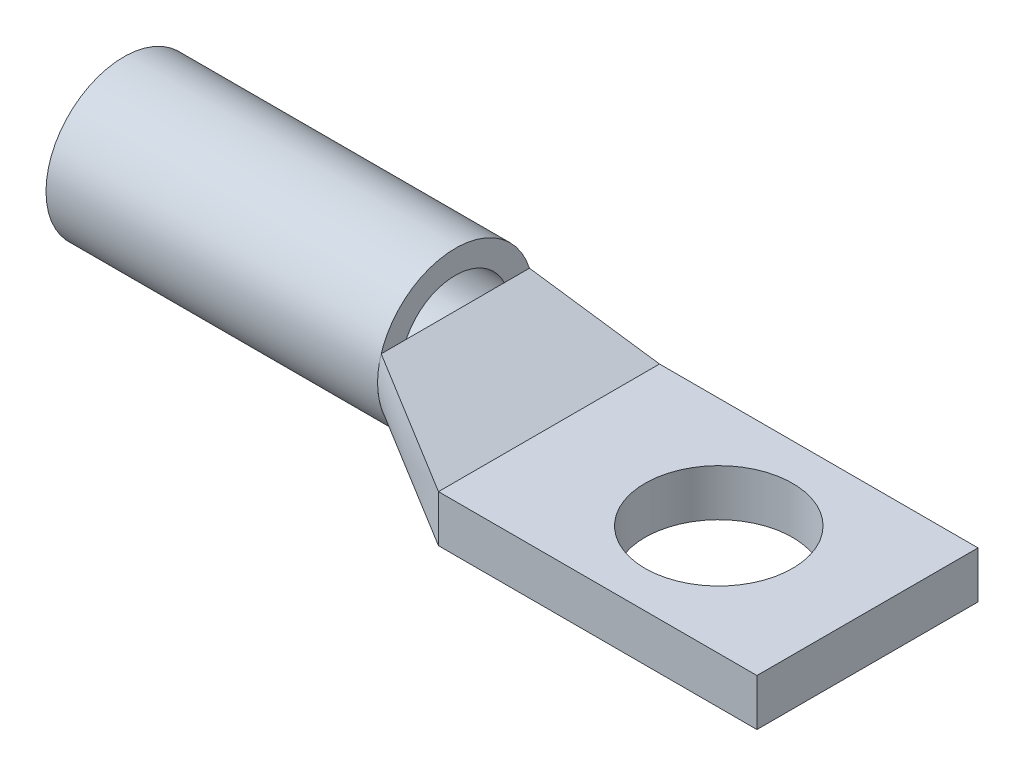
ISO-10303-21;
HEADER;
FILE_DESCRIPTION(('STEP AP214'),'2;1');
FILE_NAME('part.step','',(''),(''),'','','');
FILE_SCHEMA(('AUTOMOTIVE_DESIGN { 1 0 10303 214 1 1 1 1 }'));
ENDSEC;
DATA;
#1=APPLICATION_CONTEXT('core data for automotive mechanical design processes');
#2=APPLICATION_PROTOCOL_DEFINITION('international standard','automotive_design',2000,#1);
#3=PRODUCT_CONTEXT('',#1,'mechanical');
#4=PRODUCT('Part','Part','',(#3));
#5=PRODUCT_RELATED_PRODUCT_CATEGORY('part','',(#4));
#6=PRODUCT_DEFINITION_FORMATION('','',#4);
#7=PRODUCT_DEFINITION_CONTEXT('part definition',#1,'design');
#8=PRODUCT_DEFINITION('design','',#6,#7);
#9=PRODUCT_DEFINITION_SHAPE('','',#8);
#10=(LENGTH_UNIT() NAMED_UNIT(*) SI_UNIT(.MILLI.,.METRE.));
#11=(NAMED_UNIT(*) PLANE_ANGLE_UNIT() SI_UNIT($,.RADIAN.));
#12=(NAMED_UNIT(*) SI_UNIT($,.STERADIAN.) SOLID_ANGLE_UNIT());
#13=UNCERTAINTY_MEASURE_WITH_UNIT(LENGTH_MEASURE(1.E-05),#10,'distance_accuracy_value','');
#14=(GEOMETRIC_REPRESENTATION_CONTEXT(3) GLOBAL_UNCERTAINTY_ASSIGNED_CONTEXT((#13)) GLOBAL_UNIT_ASSIGNED_CONTEXT((#10,
#11,#12)) REPRESENTATION_CONTEXT('',''));
#15=CARTESIAN_POINT('',(0.,0.,0.));
#16=DIRECTION('',(0.,0.,1.));
#17=DIRECTION('',(1.,0.,0.));
#18=AXIS2_PLACEMENT_3D('',#15,#16,#17);
#19=CARTESIAN_POINT('',(-11.51,3.175,-7.493));
#20=CARTESIAN_POINT('',(-17.86,6.858,-5.02573517010199));
#21=CARTESIAN_POINT('',(-11.51,2.64583333333334,-7.493));
#22=CARTESIAN_POINT('',(-17.86,6.35340811545161,-5.18512272030279));
#23=CARTESIAN_POINT('',(-11.51,2.11666666666667,-7.493));
#24=CARTESIAN_POINT('',(-17.86,5.81224615684095,-5.27050000000001));
#25=CARTESIAN_POINT('',(-11.51,1.05833333333334,-7.493));
#26=CARTESIAN_POINT('',(-17.86,4.72875384315905,-5.2705));
#27=CARTESIAN_POINT('',(-11.51,0.529166666666669,-7.493));
#28=CARTESIAN_POINT('',(-17.86,4.18759188454839,-5.18512272030279));
#29=CARTESIAN_POINT('',(-11.51,0.,-7.493));
#30=CARTESIAN_POINT('',(-17.86,3.68299999999999,-5.02573517010198));
#31=B_SPLINE_SURFACE_WITH_KNOTS('',3,1,((#19,#20),(#21,#22),(#23,#24),(#25,#26),(#27,#28),(#29,
#30)),.UNSPECIFIED.,.F.,.F.,.F.,(4,2,4),(2,2),(0.,0.5,1.),(0.,1.),.UNSPECIFIED.);
#32=DIRECTION('',(0.,-1.,0.));
#33=VECTOR('',#32,1.);
#34=CARTESIAN_POINT('',(-11.51,1.5875,-7.493));
#35=LINE('',#34,#33);
#36=CARTESIAN_POINT('',(-11.51,3.175,-7.493));
#37=VERTEX_POINT('',#36);
#38=CARTESIAN_POINT('',(-11.51,0.,-7.493));
#39=VERTEX_POINT('',#38);
#40=EDGE_CURVE('E93',#37,#39,#35,.T.);
#41=DIRECTION('',(-0.819956521955377,0.475574782734118,0.31859053364819));
#42=VECTOR('',#41,1.);
#43=CARTESIAN_POINT('',(-14.685,1.8415,-6.25936758505099));
#44=LINE('',#43,#42);
#45=CARTESIAN_POINT('',(-17.86,3.68299999999999,-5.02573517010198));
#46=VERTEX_POINT('',#45);
#47=EDGE_CURVE('E96',#39,#46,#44,.T.);
#48=CARTESIAN_POINT('',(-17.86,6.858,-5.02573517010199));
#49=CARTESIAN_POINT('',(-17.86,6.35340811545161,-5.18512272030279));
#50=CARTESIAN_POINT('',(-17.86,5.81224615684095,-5.27050000000001));
#51=CARTESIAN_POINT('',(-17.86,4.72875384315905,-5.2705));
#52=CARTESIAN_POINT('',(-17.86,4.18759188454839,-5.18512272030279));
#53=CARTESIAN_POINT('',(-17.86,3.68299999999999,-5.02573517010198));
#54=B_SPLINE_CURVE_WITH_KNOTS('',3,(#48,#49,#50,#51,#52,#53),.UNSPECIFIED.,.F.,.F.,(4,2,4),(0.,
0.5,1.),.UNSPECIFIED.);
#55=CARTESIAN_POINT('',(-17.86,6.858,-5.02573517010199));
#56=VERTEX_POINT('',#55);
#57=EDGE_CURVE('E110',#46,#56,#54,.F.);
#58=DIRECTION('',(0.819956521955377,-0.475574782734118,-0.318590533648189));
#59=VECTOR('',#58,1.);
#60=CARTESIAN_POINT('',(-14.685,5.0165,-6.259367585051));
#61=LINE('',#60,#59);
#62=EDGE_CURVE('E97',#56,#37,#61,.T.);
#63=ORIENTED_EDGE('',*,*,#40,.T.);
#64=ORIENTED_EDGE('',*,*,#47,.T.);
#65=ORIENTED_EDGE('',*,*,#57,.T.);
#66=ORIENTED_EDGE('',*,*,#62,.T.);
#67=EDGE_LOOP('',(#63,#64,#65,#66));
#68=FACE_BOUND('',#67,.T.);
#69=ADVANCED_FACE('F49',(#68),#31,.T.);
#70=CARTESIAN_POINT('',(-11.51,0.,-7.493));
#71=CARTESIAN_POINT('',(-17.86,3.68299999999999,-5.02573517010198));
#72=CARTESIAN_POINT('',(-11.51,0.,-6.86858333333333));
#73=CARTESIAN_POINT('',(-17.86,3.28363855421686,-4.89958719896489));
#74=CARTESIAN_POINT('',(-11.51,0.,-6.24416666666666));
#75=CARTESIAN_POINT('',(-17.86,2.86287938133333,-4.71444038911251));
#76=CARTESIAN_POINT('',(-11.51,0.,-4.99533333333333));
#77=CARTESIAN_POINT('',(-17.86,2.02814461866666,-4.1844613520814));
#78=CARTESIAN_POINT('',(-11.51,0.,-4.37091666666666));
#79=CARTESIAN_POINT('',(-17.86,1.61438422324031,-3.83836947760264));
#80=CARTESIAN_POINT('',(-11.51,0.,-3.12208333333332));
#81=CARTESIAN_POINT('',(-17.86,0.881036184922943,-2.97201450800494));
#82=CARTESIAN_POINT('',(-11.51,0.,-2.49766666666666));
#83=CARTESIAN_POINT('',(-17.86,0.563117065793544,-2.45084174023632));
#84=CARTESIAN_POINT('',(-11.51,0.,-1.24883333333332));
#85=CARTESIAN_POINT('',(-17.86,0.121516752795473,-1.2860990805338));
#86=CARTESIAN_POINT('',(-11.51,0.,-0.624416666666653));
#87=CARTESIAN_POINT('',(-17.86,0.,-0.643728424565528));
#88=CARTESIAN_POINT('',(-11.51,0.,0.624416666666681));
#89=CARTESIAN_POINT('',(-17.86,0.,0.643728424565536));
#90=CARTESIAN_POINT('',(-11.51,0.,1.24883333333335));
#91=CARTESIAN_POINT('',(-17.86,0.121516752795476,1.2860990805338));
#92=CARTESIAN_POINT('',(-11.51,0.,2.49766666666668));
#93=CARTESIAN_POINT('',(-17.86,0.56311706579355,2.45084174023632));
#94=CARTESIAN_POINT('',(-11.51,0.,3.12208333333334));
#95=CARTESIAN_POINT('',(-17.86,0.88103618492295,2.97201450800495));
#96=CARTESIAN_POINT('',(-11.51,0.,4.37091666666668));
#97=CARTESIAN_POINT('',(-17.86,1.61438422324032,3.83836947760265));
#98=CARTESIAN_POINT('',(-11.51,0.,4.99533333333334));
#99=CARTESIAN_POINT('',(-17.86,2.02814461866667,4.18446135208141));
#100=CARTESIAN_POINT('',(-11.51,0.,6.24416666666667));
#101=CARTESIAN_POINT('',(-17.86,2.86287938133334,4.71444038911251));
#102=CARTESIAN_POINT('',(-11.51,0.,6.86858333333334));
#103=CARTESIAN_POINT('',(-17.86,3.28363855421687,4.89958719896489));
#104=CARTESIAN_POINT('',(-11.51,0.,7.493));
#105=CARTESIAN_POINT('',(-17.86,3.683,5.02573517010198));
#106=B_SPLINE_SURFACE_WITH_KNOTS('',3,1,((#70,#71),(#72,#73),(#74,#75),(#76,#77),(#78,#79),(#80,
#81),(#82,#83),(#84,#85),(#86,#87),(#88,#89),(#90,#91),(#92,#93),(#94,#95),(#96,#97),(#98,#99),
(#100,#101),(#102,#103),(#104,#105)),.UNSPECIFIED.,.F.,.F.,.F.,(4,2,2,2,2,2,2,2,4),(2,2),(0.,
0.125,0.25,0.375,0.5,0.625,0.75,0.875,1.),(0.,1.),.UNSPECIFIED.);
#107=DIRECTION('',(0.,0.,1.));
#108=VECTOR('',#107,1.);
#109=CARTESIAN_POINT('',(-11.51,0.,0.));
#110=LINE('',#109,#108);
#111=CARTESIAN_POINT('',(-11.51,0.,7.493));
#112=VERTEX_POINT('',#111);
#113=EDGE_CURVE('E102',#39,#112,#110,.T.);
#114=DIRECTION('',(-0.819956521955376,0.475574782734119,-0.318590533648189));
#115=VECTOR('',#114,1.);
#116=CARTESIAN_POINT('',(-14.685,1.8415,6.25936758505099));
#117=LINE('',#116,#115);
#118=CARTESIAN_POINT('',(-17.86,3.683,5.02573517010198));
#119=VERTEX_POINT('',#118);
#120=EDGE_CURVE('E106',#112,#119,#117,.T.);
#121=CARTESIAN_POINT('',(-17.86,3.68299999999999,-5.02573517010198));
#122=CARTESIAN_POINT('',(-17.86,3.28363855421686,-4.89958719896489));
#123=CARTESIAN_POINT('',(-17.86,2.86287938133333,-4.71444038911251));
#124=CARTESIAN_POINT('',(-17.86,2.02814461866666,-4.1844613520814));
#125=CARTESIAN_POINT('',(-17.86,1.61438422324031,-3.83836947760264));
#126=CARTESIAN_POINT('',(-17.86,0.881036184922943,-2.97201450800494));
#127=CARTESIAN_POINT('',(-17.86,0.563117065793544,-2.45084174023632));
#128=CARTESIAN_POINT('',(-17.86,0.121516752795473,-1.2860990805338));
#129=CARTESIAN_POINT('',(-17.86,0.,-0.643728424565528));
#130=CARTESIAN_POINT('',(-17.86,0.,0.643728424565536));
#131=CARTESIAN_POINT('',(-17.86,0.121516752795476,1.2860990805338));
#132=CARTESIAN_POINT('',(-17.86,0.56311706579355,2.45084174023632));
#133=CARTESIAN_POINT('',(-17.86,0.88103618492295,2.97201450800495));
#134=CARTESIAN_POINT('',(-17.86,1.61438422324032,3.83836947760265));
#135=CARTESIAN_POINT('',(-17.86,2.02814461866667,4.18446135208141));
#136=CARTESIAN_POINT('',(-17.86,2.86287938133334,4.71444038911251));
#137=CARTESIAN_POINT('',(-17.86,3.28363855421687,4.89958719896489));
#138=CARTESIAN_POINT('',(-17.86,3.683,5.02573517010198));
#139=B_SPLINE_CURVE_WITH_KNOTS('',3,(#121,#122,#123,#124,#125,#126,#127,#128,#129,#130,#131,
#132,#133,#134,#135,#136,#137,#138),.UNSPECIFIED.,.F.,.F.,(4,2,2,2,2,2,2,2,4),(0.,0.125,0.25,
0.375,0.5,0.625,0.75,0.875,1.),.UNSPECIFIED.);
#140=EDGE_CURVE('E100',#119,#46,#139,.F.);
#141=ORIENTED_EDGE('',*,*,#113,.T.);
#142=ORIENTED_EDGE('',*,*,#120,.T.);
#143=ORIENTED_EDGE('',*,*,#140,.T.);
#144=ORIENTED_EDGE('',*,*,#47,.F.);
#145=EDGE_LOOP('',(#141,#142,#143,#144));
#146=FACE_BOUND('',#145,.T.);
#147=ADVANCED_FACE('F108',(#146),#106,.T.);
#148=CARTESIAN_POINT('',(-1.51935348697994,-2.61957497755163,0.));
#149=DIRECTION('',(0.501718089771846,0.865031189261803,0.));
#150=DIRECTION('',(-0.865031189261803,0.501718089771846,0.));
#151=AXIS2_PLACEMENT_3D('',#148,#149,#150);
#152=PLANE('',#151);
#153=ORIENTED_EDGE('',*,*,#62,.F.);
#154=DIRECTION('',(0.,0.,1.));
#155=VECTOR('',#154,1.);
#156=CARTESIAN_POINT('',(-17.86,6.858,5.02573517010198));
#157=LINE('',#156,#155);
#158=CARTESIAN_POINT('',(-17.86,6.858,5.02573517010198));
#159=VERTEX_POINT('',#158);
#160=EDGE_CURVE('E65',#56,#159,#157,.T.);
#161=ORIENTED_EDGE('',*,*,#160,.T.);
#162=DIRECTION('',(-0.819956521955377,0.475574782734118,-0.318590533648189));
#163=VECTOR('',#162,1.);
#164=CARTESIAN_POINT('',(-14.685,5.0165,6.25936758505099));
#165=LINE('',#164,#163);
#166=CARTESIAN_POINT('',(-11.51,3.175,7.493));
#167=VERTEX_POINT('',#166);
#168=EDGE_CURVE('E54',#167,#159,#165,.T.);
#169=ORIENTED_EDGE('',*,*,#168,.F.);
#170=DIRECTION('',(0.,0.,-1.));
#171=VECTOR('',#170,1.);
#172=CARTESIAN_POINT('',(-11.51,3.175,7.493));
#173=LINE('',#172,#171);
#174=EDGE_CURVE('E124',#167,#37,#173,.T.);
#175=ORIENTED_EDGE('',*,*,#174,.T.);
#176=EDGE_LOOP('',(#153,#161,#169,#175));
#177=FACE_BOUND('',#176,.T.);
#178=ADVANCED_FACE('F139',(#177),#152,.T.);
#179=CARTESIAN_POINT('',(-11.51,0.,7.493));
#180=CARTESIAN_POINT('',(-17.86,3.683,5.02573517010198));
#181=CARTESIAN_POINT('',(-11.51,0.529166666666666,7.493));
#182=CARTESIAN_POINT('',(-17.86,4.1875918845484,5.18512272030279));
#183=CARTESIAN_POINT('',(-11.51,1.05833333333333,7.493));
#184=CARTESIAN_POINT('',(-17.86,4.72875384315906,5.2705));
#185=CARTESIAN_POINT('',(-11.51,2.11666666666667,7.493));
#186=CARTESIAN_POINT('',(-17.86,5.81224615684095,5.2705));
#187=CARTESIAN_POINT('',(-11.51,2.64583333333333,7.493));
#188=CARTESIAN_POINT('',(-17.86,6.35340811545161,5.18512272030279));
#189=CARTESIAN_POINT('',(-11.51,3.175,7.493));
#190=CARTESIAN_POINT('',(-17.86,6.858,5.02573517010198));
#191=B_SPLINE_SURFACE_WITH_KNOTS('',3,1,((#179,#180),(#181,#182),(#183,#184),(#185,#186),(#187,
#188),(#189,#190)),.UNSPECIFIED.,.F.,.F.,.F.,(4,2,4),(2,2),(0.,0.5,1.),(0.,1.),.UNSPECIFIED.);
#192=DIRECTION('',(0.,1.,0.));
#193=VECTOR('',#192,1.);
#194=CARTESIAN_POINT('',(-11.51,1.5875,7.493));
#195=LINE('',#194,#193);
#196=EDGE_CURVE('E13',#112,#167,#195,.T.);
#197=CARTESIAN_POINT('',(-17.86,3.683,5.02573517010198));
#198=CARTESIAN_POINT('',(-17.86,4.1875918845484,5.18512272030279));
#199=CARTESIAN_POINT('',(-17.86,4.72875384315906,5.2705));
#200=CARTESIAN_POINT('',(-17.86,5.81224615684095,5.2705));
#201=CARTESIAN_POINT('',(-17.86,6.35340811545161,5.18512272030279));
#202=CARTESIAN_POINT('',(-17.86,6.858,5.02573517010198));
#203=B_SPLINE_CURVE_WITH_KNOTS('',3,(#197,#198,#199,#200,#201,#202),.UNSPECIFIED.,.F.,.F.,(4,2,
4),(0.,0.5,1.),.UNSPECIFIED.);
#204=EDGE_CURVE('E127',#159,#119,#203,.F.);
#205=ORIENTED_EDGE('',*,*,#196,.T.);
#206=ORIENTED_EDGE('',*,*,#168,.T.);
#207=ORIENTED_EDGE('',*,*,#204,.T.);
#208=ORIENTED_EDGE('',*,*,#120,.F.);
#209=EDGE_LOOP('',(#205,#206,#207,#208));
#210=FACE_BOUND('',#209,.T.);
#211=ADVANCED_FACE('F50',(#210),#191,.T.);
#212=OPEN_SHELL('',(#69,#147,#178,#211));
#213=SHELL_BASED_SURFACE_MODEL('B2',(#212));
#214=CARTESIAN_POINT('',(-2.95277483902519,5.2705,0.));
#215=DIRECTION('',(-1.,0.,0.));
#216=DIRECTION('',(0.,0.,1.));
#217=AXIS2_PLACEMENT_3D('',#214,#215,#216);
#218=CYLINDRICAL_SURFACE('',#217,5.2705);
#219=CARTESIAN_POINT('',(-17.86,5.2705,0.));
#220=DIRECTION('',(-1.,0.,0.));
#221=DIRECTION('',(0.,0.,1.));
#222=AXIS2_PLACEMENT_3D('',#219,#220,#221);
#223=CIRCLE('',#222,5.2705);
#224=CARTESIAN_POINT('',(-17.86,5.2705,5.2705));
#225=VERTEX_POINT('',#224);
#226=EDGE_CURVE('E225',#225,#225,#223,.F.);
#227=ORIENTED_EDGE('',*,*,#226,.F.);
#228=EDGE_LOOP('',(#227));
#229=FACE_BOUND('',#228,.T.);
#230=CARTESIAN_POINT('',(-40.339,5.2705,0.));
#231=DIRECTION('',(-1.,0.,0.));
#232=DIRECTION('',(0.,0.,1.));
#233=AXIS2_PLACEMENT_3D('',#230,#231,#232);
#234=CIRCLE('',#233,5.2705);
#235=CARTESIAN_POINT('',(-40.339,5.2705,5.2705));
#236=VERTEX_POINT('',#235);
#237=EDGE_CURVE('E229',#236,#236,#234,.T.);
#238=ORIENTED_EDGE('',*,*,#237,.F.);
#239=EDGE_LOOP('',(#238));
#240=FACE_BOUND('',#239,.T.);
#241=ADVANCED_FACE('F219',(#229,#240),#218,.T.);
#242=CARTESIAN_POINT('',(-40.339,5.2705,0.));
#243=DIRECTION('',(-1.,0.,0.));
#244=DIRECTION('',(0.,0.,1.));
#245=AXIS2_PLACEMENT_3D('',#242,#243,#244);
#246=PLANE('',#245);
#247=CARTESIAN_POINT('',(-40.339,5.2705,0.));
#248=DIRECTION('',(-1.,0.,0.));
#249=DIRECTION('',(0.,0.,1.));
#250=AXIS2_PLACEMENT_3D('',#247,#248,#249);
#251=CIRCLE('',#250,3.683);
#252=CARTESIAN_POINT('',(-40.339,5.2705,3.683));
#253=VERTEX_POINT('',#252);
#254=EDGE_CURVE('E234',#253,#253,#251,.T.);
#255=ORIENTED_EDGE('',*,*,#254,.F.);
#256=EDGE_LOOP('',(#255));
#257=FACE_BOUND('',#256,.T.);
#258=ORIENTED_EDGE('',*,*,#237,.T.);
#259=EDGE_LOOP('',(#258));
#260=FACE_BOUND('',#259,.T.);
#261=ADVANCED_FACE('F241',(#257,#260),#246,.T.);
#262=CARTESIAN_POINT('',(-2.95277483902519,5.2705,0.));
#263=DIRECTION('',(-1.,0.,0.));
#264=DIRECTION('',(0.,0.,1.));
#265=AXIS2_PLACEMENT_3D('',#262,#263,#264);
#266=CYLINDRICAL_SURFACE('',#265,3.683);
#267=CARTESIAN_POINT('',(-17.86,5.2705,0.));
#268=DIRECTION('',(-1.,0.,0.));
#269=DIRECTION('',(0.,0.,1.));
#270=AXIS2_PLACEMENT_3D('',#267,#268,#269);
#271=CIRCLE('',#270,3.683);
#272=CARTESIAN_POINT('',(-17.86,5.2705,3.683));
#273=VERTEX_POINT('',#272);
#274=EDGE_CURVE('E48',#273,#273,#271,.F.);
#275=ORIENTED_EDGE('',*,*,#274,.T.);
#276=EDGE_LOOP('',(#275));
#277=FACE_BOUND('',#276,.T.);
#278=ORIENTED_EDGE('',*,*,#254,.T.);
#279=EDGE_LOOP('',(#278));
#280=FACE_BOUND('',#279,.T.);
#281=ADVANCED_FACE('F239',(#277,#280),#266,.F.);
#282=CARTESIAN_POINT('',(-17.86,0.,0.));
#283=DIRECTION('',(-1.,0.,0.));
#284=DIRECTION('',(0.,0.,1.));
#285=AXIS2_PLACEMENT_3D('',#282,#283,#284);
#286=PLANE('',#285);
#287=ORIENTED_EDGE('',*,*,#226,.T.);
#288=EDGE_LOOP('',(#287));
#289=FACE_BOUND('',#288,.T.);
#290=ORIENTED_EDGE('',*,*,#274,.F.);
#291=EDGE_LOOP('',(#290));
#292=FACE_BOUND('',#291,.T.);
#293=ADVANCED_FACE('F260',(#289,#292),#286,.F.);
#294=CLOSED_SHELL('',(#241,#261,#281,#293));
#295=MANIFOLD_SOLID_BREP('B7',#294);
#296=CARTESIAN_POINT('',(0.,3.175,0.));
#297=DIRECTION('',(0.,-1.,0.));
#298=DIRECTION('',(0.,0.,-1.));
#299=AXIS2_PLACEMENT_3D('',#296,#297,#298);
#300=PLANE('',#299);
#301=DIRECTION('',(0.,0.,-1.));
#302=VECTOR('',#301,1.);
#303=CARTESIAN_POINT('',(10.08,3.175,-7.493));
#304=LINE('',#303,#302);
#305=CARTESIAN_POINT('',(10.08,3.175,7.493));
#306=VERTEX_POINT('',#305);
#307=CARTESIAN_POINT('',(10.08,3.175,-7.493));
#308=VERTEX_POINT('',#307);
#309=EDGE_CURVE('E332',#306,#308,#304,.T.);
#310=ORIENTED_EDGE('',*,*,#309,.T.);
#311=DIRECTION('',(-1.,0.,0.));
#312=VECTOR('',#311,1.);
#313=CARTESIAN_POINT('',(10.08,3.175,-7.493));
#314=LINE('',#313,#312);
#315=CARTESIAN_POINT('',(-11.51,3.175,-7.493));
#316=VERTEX_POINT('',#315);
#317=EDGE_CURVE('E327',#308,#316,#314,.T.);
#318=ORIENTED_EDGE('',*,*,#317,.T.);
#319=DIRECTION('',(0.,0.,1.));
#320=VECTOR('',#319,1.);
#321=CARTESIAN_POINT('',(-11.51,3.175,-7.493));
#322=LINE('',#321,#320);
#323=CARTESIAN_POINT('',(-11.51,3.175,7.493));
#324=VERTEX_POINT('',#323);
#325=EDGE_CURVE('E330',#316,#324,#322,.T.);
#326=ORIENTED_EDGE('',*,*,#325,.T.);
#327=DIRECTION('',(1.,0.,0.));
#328=VECTOR('',#327,1.);
#329=CARTESIAN_POINT('',(10.08,3.175,7.493));
#330=LINE('',#329,#328);
#331=EDGE_CURVE('E297',#324,#306,#330,.T.);
#332=ORIENTED_EDGE('',*,*,#331,.T.);
#333=EDGE_LOOP('',(#310,#318,#326,#332));
#334=FACE_BOUND('',#333,.T.);
#335=CARTESIAN_POINT('',(0.,3.175,0.));
#336=DIRECTION('',(0.,1.,0.));
#337=DIRECTION('',(0.,0.,1.));
#338=AXIS2_PLACEMENT_3D('',#335,#336,#337);
#339=CIRCLE('',#338,5.);
#340=CARTESIAN_POINT('',(0.,3.175,5.));
#341=VERTEX_POINT('',#340);
#342=EDGE_CURVE('E347',#341,#341,#339,.T.);
#343=ORIENTED_EDGE('',*,*,#342,.F.);
#344=EDGE_LOOP('',(#343));
#345=FACE_BOUND('',#344,.T.);
#346=ADVANCED_FACE('F280',(#334,#345),#300,.F.);
#347=CARTESIAN_POINT('',(0.,0.,0.));
#348=DIRECTION('',(0.,-1.,0.));
#349=DIRECTION('',(0.,0.,-1.));
#350=AXIS2_PLACEMENT_3D('',#347,#348,#349);
#351=PLANE('',#350);
#352=DIRECTION('',(0.,0.,-1.));
#353=VECTOR('',#352,1.);
#354=CARTESIAN_POINT('',(10.08,0.,-7.493));
#355=LINE('',#354,#353);
#356=CARTESIAN_POINT('',(10.08,0.,7.493));
#357=VERTEX_POINT('',#356);
#358=CARTESIAN_POINT('',(10.08,0.,-7.493));
#359=VERTEX_POINT('',#358);
#360=EDGE_CURVE('E344',#357,#359,#355,.T.);
#361=ORIENTED_EDGE('',*,*,#360,.F.);
#362=DIRECTION('',(1.,0.,0.));
#363=VECTOR('',#362,1.);
#364=CARTESIAN_POINT('',(10.08,0.,7.493));
#365=LINE('',#364,#363);
#366=CARTESIAN_POINT('',(-11.51,0.,7.493));
#367=VERTEX_POINT('',#366);
#368=EDGE_CURVE('E320',#367,#357,#365,.T.);
#369=ORIENTED_EDGE('',*,*,#368,.F.);
#370=DIRECTION('',(0.,0.,1.));
#371=VECTOR('',#370,1.);
#372=CARTESIAN_POINT('',(-11.51,0.,-7.493));
#373=LINE('',#372,#371);
#374=CARTESIAN_POINT('',(-11.51,0.,-7.493));
#375=VERTEX_POINT('',#374);
#376=EDGE_CURVE('E314',#375,#367,#373,.T.);
#377=ORIENTED_EDGE('',*,*,#376,.F.);
#378=DIRECTION('',(-1.,0.,0.));
#379=VECTOR('',#378,1.);
#380=CARTESIAN_POINT('',(10.08,0.,-7.493));
#381=LINE('',#380,#379);
#382=EDGE_CURVE('E336',#359,#375,#381,.T.);
#383=ORIENTED_EDGE('',*,*,#382,.F.);
#384=EDGE_LOOP('',(#361,#369,#377,#383));
#385=FACE_BOUND('',#384,.T.);
#386=CARTESIAN_POINT('',(0.,0.,0.));
#387=DIRECTION('',(0.,1.,0.));
#388=DIRECTION('',(0.,0.,1.));
#389=AXIS2_PLACEMENT_3D('',#386,#387,#388);
#390=CIRCLE('',#389,5.);
#391=CARTESIAN_POINT('',(0.,0.,5.));
#392=VERTEX_POINT('',#391);
#393=EDGE_CURVE('E359',#392,#392,#390,.T.);
#394=ORIENTED_EDGE('',*,*,#393,.T.);
#395=EDGE_LOOP('',(#394));
#396=FACE_BOUND('',#395,.T.);
#397=ADVANCED_FACE('F355',(#385,#396),#351,.T.);
#398=CARTESIAN_POINT('',(10.08,3.175,-7.493));
#399=DIRECTION('',(-1.,0.,0.));
#400=DIRECTION('',(0.,0.,1.));
#401=AXIS2_PLACEMENT_3D('',#398,#399,#400);
#402=PLANE('',#401);
#403=ORIENTED_EDGE('',*,*,#360,.T.);
#404=DIRECTION('',(0.,-1.,0.));
#405=VECTOR('',#404,1.);
#406=CARTESIAN_POINT('',(10.08,3.175,-7.493));
#407=LINE('',#406,#405);
#408=EDGE_CURVE('E217',#308,#359,#407,.T.);
#409=ORIENTED_EDGE('',*,*,#408,.F.);
#410=ORIENTED_EDGE('',*,*,#309,.F.);
#411=DIRECTION('',(0.,-1.,0.));
#412=VECTOR('',#411,1.);
#413=CARTESIAN_POINT('',(10.08,3.175,7.493));
#414=LINE('',#413,#412);
#415=EDGE_CURVE('E340',#306,#357,#414,.T.);
#416=ORIENTED_EDGE('',*,*,#415,.T.);
#417=EDGE_LOOP('',(#403,#409,#410,#416));
#418=FACE_BOUND('',#417,.T.);
#419=ADVANCED_FACE('F282',(#418),#402,.F.);
#420=CARTESIAN_POINT('',(10.08,3.175,-7.493));
#421=DIRECTION('',(0.,0.,1.));
#422=DIRECTION('',(1.,0.,0.));
#423=AXIS2_PLACEMENT_3D('',#420,#421,#422);
#424=PLANE('',#423);
#425=ORIENTED_EDGE('',*,*,#382,.T.);
#426=DIRECTION('',(0.,-1.,0.));
#427=VECTOR('',#426,1.);
#428=CARTESIAN_POINT('',(-11.51,3.175,-7.493));
#429=LINE('',#428,#427);
#430=EDGE_CURVE('E289',#316,#375,#429,.T.);
#431=ORIENTED_EDGE('',*,*,#430,.F.);
#432=ORIENTED_EDGE('',*,*,#317,.F.);
#433=ORIENTED_EDGE('',*,*,#408,.T.);
#434=EDGE_LOOP('',(#425,#431,#432,#433));
#435=FACE_BOUND('',#434,.T.);
#436=ADVANCED_FACE('F335',(#435),#424,.F.);
#437=CARTESIAN_POINT('',(-11.51,3.175,-7.493));
#438=DIRECTION('',(1.,0.,0.));
#439=DIRECTION('',(0.,0.,-1.));
#440=AXIS2_PLACEMENT_3D('',#437,#438,#439);
#441=PLANE('',#440);
#442=ORIENTED_EDGE('',*,*,#376,.T.);
#443=DIRECTION('',(0.,-1.,0.));
#444=VECTOR('',#443,1.);
#445=CARTESIAN_POINT('',(-11.51,3.175,7.493));
#446=LINE('',#445,#444);
#447=EDGE_CURVE('E337',#324,#367,#446,.T.);
#448=ORIENTED_EDGE('',*,*,#447,.F.);
#449=ORIENTED_EDGE('',*,*,#325,.F.);
#450=ORIENTED_EDGE('',*,*,#430,.T.);
#451=EDGE_LOOP('',(#442,#448,#449,#450));
#452=FACE_BOUND('',#451,.T.);
#453=ADVANCED_FACE('F338',(#452),#441,.F.);
#454=CARTESIAN_POINT('',(10.08,3.175,7.493));
#455=DIRECTION('',(0.,0.,-1.));
#456=DIRECTION('',(-1.,0.,0.));
#457=AXIS2_PLACEMENT_3D('',#454,#455,#456);
#458=PLANE('',#457);
#459=ORIENTED_EDGE('',*,*,#368,.T.);
#460=ORIENTED_EDGE('',*,*,#415,.F.);
#461=ORIENTED_EDGE('',*,*,#331,.F.);
#462=ORIENTED_EDGE('',*,*,#447,.T.);
#463=EDGE_LOOP('',(#459,#460,#461,#462));
#464=FACE_BOUND('',#463,.T.);
#465=ADVANCED_FACE('F352',(#464),#458,.F.);
#466=CARTESIAN_POINT('',(0.,3.175,0.));
#467=DIRECTION('',(0.,-1.,0.));
#468=DIRECTION('',(0.,0.,-1.));
#469=AXIS2_PLACEMENT_3D('',#466,#467,#468);
#470=CYLINDRICAL_SURFACE('',#469,5.);
#471=ORIENTED_EDGE('',*,*,#342,.T.);
#472=EDGE_LOOP('',(#471));
#473=FACE_BOUND('',#472,.T.);
#474=ORIENTED_EDGE('',*,*,#393,.F.);
#475=EDGE_LOOP('',(#474));
#476=FACE_BOUND('',#475,.T.);
#477=ADVANCED_FACE('F365',(#473,#476),#470,.F.);
#478=CLOSED_SHELL('',(#346,#397,#419,#436,#453,#465,#477));
#479=MANIFOLD_SOLID_BREP('B43',#478);
#480=ADVANCED_BREP_SHAPE_REPRESENTATION('',(#18,#295,#479),#14);
#481=MANIFOLD_SURFACE_SHAPE_REPRESENTATION('',(#18,#213),#14);
#482=SHAPE_REPRESENTATION('',(#18),#14);
#483=SHAPE_DEFINITION_REPRESENTATION(#9,#482);
#484=SHAPE_REPRESENTATION_RELATIONSHIP('','',#482,#480);
#485=SHAPE_REPRESENTATION_RELATIONSHIP('','',#482,#481);
ENDSEC;
END-ISO-10303-21;
